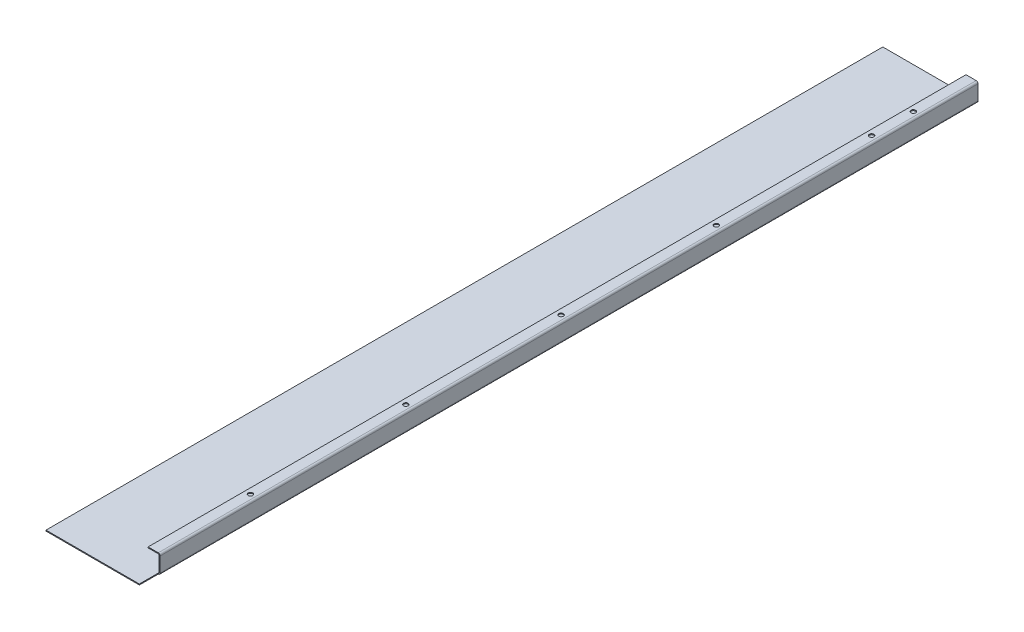
ISO-10303-21;
HEADER;
FILE_DESCRIPTION(('STEP AP214'),'2;1');
FILE_NAME('part.step','',(''),(''),'','','');
FILE_SCHEMA(('AUTOMOTIVE_DESIGN { 1 0 10303 214 1 1 1 1 }'));
ENDSEC;
DATA;
#1=APPLICATION_CONTEXT('core data for automotive mechanical design processes');
#2=APPLICATION_PROTOCOL_DEFINITION('international standard','automotive_design',2000,#1);
#3=PRODUCT_CONTEXT('',#1,'mechanical');
#4=PRODUCT('Part','Part','',(#3));
#5=PRODUCT_RELATED_PRODUCT_CATEGORY('part','',(#4));
#6=PRODUCT_DEFINITION_FORMATION('','',#4);
#7=PRODUCT_DEFINITION_CONTEXT('part definition',#1,'design');
#8=PRODUCT_DEFINITION('design','',#6,#7);
#9=PRODUCT_DEFINITION_SHAPE('','',#8);
#10=(LENGTH_UNIT() NAMED_UNIT(*) SI_UNIT(.MILLI.,.METRE.));
#11=(NAMED_UNIT(*) PLANE_ANGLE_UNIT() SI_UNIT($,.RADIAN.));
#12=(NAMED_UNIT(*) SI_UNIT($,.STERADIAN.) SOLID_ANGLE_UNIT());
#13=UNCERTAINTY_MEASURE_WITH_UNIT(LENGTH_MEASURE(1.E-05),#10,'distance_accuracy_value','');
#14=(GEOMETRIC_REPRESENTATION_CONTEXT(3) GLOBAL_UNCERTAINTY_ASSIGNED_CONTEXT((#13)) GLOBAL_UNIT_ASSIGNED_CONTEXT((#10,
#11,#12)) REPRESENTATION_CONTEXT('',''));
#15=CARTESIAN_POINT('',(0.,0.,0.));
#16=DIRECTION('',(0.,0.,1.));
#17=DIRECTION('',(1.,0.,0.));
#18=AXIS2_PLACEMENT_3D('',#15,#16,#17);
#19=CARTESIAN_POINT('',(103.,-3.79652571919077E-13,0.));
#20=DIRECTION('',(-1.,0.,0.));
#21=DIRECTION('',(0.,-1.,0.));
#22=AXIS2_PLACEMENT_3D('',#19,#20,#21);
#23=PLANE('',#22);
#24=DIRECTION('',(0.,-1.,0.));
#25=VECTOR('',#24,1.);
#26=CARTESIAN_POINT('',(103.,-3.79813140003343E-13,-20.5));
#27=LINE('',#26,#25);
#28=CARTESIAN_POINT('',(103.,17.,-20.5));
#29=VERTEX_POINT('',#28);
#30=CARTESIAN_POINT('',(103.,0.999999999999956,-20.5));
#31=VERTEX_POINT('',#30);
#32=EDGE_CURVE('E367',#29,#31,#27,.T.);
#33=ORIENTED_EDGE('',*,*,#32,.T.);
#34=DIRECTION('',(0.,0.,-1.));
#35=VECTOR('',#34,1.);
#36=CARTESIAN_POINT('',(103.,0.999999999999997,0.));
#37=LINE('',#36,#35);
#38=CARTESIAN_POINT('',(103.,0.999999999999956,-905.2));
#39=VERTEX_POINT('',#38);
#40=EDGE_CURVE('E237',#39,#31,#37,.F.);
#41=ORIENTED_EDGE('',*,*,#40,.F.);
#42=DIRECTION('',(0.,1.,0.));
#43=VECTOR('',#42,1.);
#44=CARTESIAN_POINT('',(103.,-3.79652571919076E-13,-905.2));
#45=LINE('',#44,#43);
#46=CARTESIAN_POINT('',(103.,17.,-905.2));
#47=VERTEX_POINT('',#46);
#48=EDGE_CURVE('E232',#39,#47,#45,.T.);
#49=ORIENTED_EDGE('',*,*,#48,.T.);
#50=DIRECTION('',(0.,0.,-1.));
#51=VECTOR('',#50,1.);
#52=CARTESIAN_POINT('',(103.,17.,-905.2));
#53=LINE('',#52,#51);
#54=EDGE_CURVE('E220',#47,#29,#53,.F.);
#55=ORIENTED_EDGE('',*,*,#54,.T.);
#56=EDGE_LOOP('',(#33,#41,#49,#55));
#57=FACE_BOUND('',#56,.T.);
#58=ADVANCED_FACE('F78',(#57),#23,.F.);
#59=CARTESIAN_POINT('',(102.,-3.76161090580234E-13,0.));
#60=DIRECTION('',(-1.,0.,0.));
#61=DIRECTION('',(0.,-1.,0.));
#62=AXIS2_PLACEMENT_3D('',#59,#60,#61);
#63=PLANE('',#62);
#64=DIRECTION('',(0.,0.,-1.));
#65=VECTOR('',#64,1.);
#66=CARTESIAN_POINT('',(102.,1.,0.));
#67=LINE('',#66,#65);
#68=CARTESIAN_POINT('',(102.,0.999999999999959,-20.5));
#69=VERTEX_POINT('',#68);
#70=CARTESIAN_POINT('',(102.,0.99999999999998,-905.2));
#71=VERTEX_POINT('',#70);
#72=EDGE_CURVE('E231',#69,#71,#67,.T.);
#73=ORIENTED_EDGE('',*,*,#72,.F.);
#74=DIRECTION('',(0.,-1.,0.));
#75=VECTOR('',#74,1.);
#76=CARTESIAN_POINT('',(102.,-3.76161090580234E-13,-20.5));
#77=LINE('',#76,#75);
#78=CARTESIAN_POINT('',(102.,17.,-20.5));
#79=VERTEX_POINT('',#78);
#80=EDGE_CURVE('E368',#79,#69,#77,.T.);
#81=ORIENTED_EDGE('',*,*,#80,.F.);
#82=DIRECTION('',(0.,0.,-1.));
#83=VECTOR('',#82,1.);
#84=CARTESIAN_POINT('',(102.,17.,-905.2));
#85=LINE('',#84,#83);
#86=CARTESIAN_POINT('',(102.,17.,-905.2));
#87=VERTEX_POINT('',#86);
#88=EDGE_CURVE('E103',#87,#79,#85,.F.);
#89=ORIENTED_EDGE('',*,*,#88,.F.);
#90=DIRECTION('',(0.,-1.,0.));
#91=VECTOR('',#90,1.);
#92=CARTESIAN_POINT('',(102.,19.,-905.2));
#93=LINE('',#92,#91);
#94=EDGE_CURVE('E235',#71,#87,#93,.F.);
#95=ORIENTED_EDGE('',*,*,#94,.F.);
#96=EDGE_LOOP('',(#73,#81,#89,#95));
#97=FACE_BOUND('',#96,.T.);
#98=ADVANCED_FACE('F385',(#97),#63,.T.);
#99=CARTESIAN_POINT('',(101.,0.999999999999984,-905.2));
#100=DIRECTION('',(0.,0.,-1.));
#101=DIRECTION('',(1.,0.,0.));
#102=AXIS2_PLACEMENT_3D('',#99,#100,#101);
#103=CYLINDRICAL_SURFACE('',#102,2.00000000000008);
#104=ORIENTED_EDGE('',*,*,#40,.T.);
#105=CARTESIAN_POINT('',(101.,0.9999999999999,-20.5));
#106=DIRECTION('',(0.,0.,-1.));
#107=DIRECTION('',(-1.,0.,0.));
#108=AXIS2_PLACEMENT_3D('',#105,#106,#107);
#109=CIRCLE('',#108,2.);
#110=CARTESIAN_POINT('',(101.,-1.0000000000001,-20.5));
#111=VERTEX_POINT('',#110);
#112=EDGE_CURVE('E337',#31,#111,#109,.T.);
#113=ORIENTED_EDGE('',*,*,#112,.T.);
#114=DIRECTION('',(0.,0.,-1.));
#115=VECTOR('',#114,1.);
#116=CARTESIAN_POINT('',(101.,-1.0000000000001,-905.2));
#117=LINE('',#116,#115);
#118=CARTESIAN_POINT('',(101.,-1.0000000000001,-905.2));
#119=VERTEX_POINT('',#118);
#120=EDGE_CURVE('E244',#119,#111,#117,.F.);
#121=ORIENTED_EDGE('',*,*,#120,.F.);
#122=CARTESIAN_POINT('',(101.,0.999999999999984,-905.2));
#123=DIRECTION('',(0.,0.,-1.));
#124=DIRECTION('',(-1.,0.,0.));
#125=AXIS2_PLACEMENT_3D('',#122,#123,#124);
#126=CIRCLE('',#125,2.00000000000008);
#127=EDGE_CURVE('E248',#39,#119,#126,.T.);
#128=ORIENTED_EDGE('',*,*,#127,.F.);
#129=EDGE_LOOP('',(#104,#113,#121,#128));
#130=FACE_BOUND('',#129,.T.);
#131=ADVANCED_FACE('F391',(#130),#103,.T.);
#132=CARTESIAN_POINT('',(101.,0.999999999999984,-905.2));
#133=DIRECTION('',(0.,0.,-1.));
#134=DIRECTION('',(1.,0.,0.));
#135=AXIS2_PLACEMENT_3D('',#132,#133,#134);
#136=CYLINDRICAL_SURFACE('',#135,1.00000000000008);
#137=CARTESIAN_POINT('',(101.,0.9999999999999,-20.5));
#138=DIRECTION('',(0.,0.,1.));
#139=DIRECTION('',(1.,0.,0.));
#140=AXIS2_PLACEMENT_3D('',#137,#138,#139);
#141=CIRCLE('',#140,1.);
#142=CARTESIAN_POINT('',(101.,-1.00397121172158E-13,-20.5000000000001));
#143=VERTEX_POINT('',#142);
#144=EDGE_CURVE('E353',#69,#143,#141,.F.);
#145=ORIENTED_EDGE('',*,*,#144,.F.);
#146=ORIENTED_EDGE('',*,*,#72,.T.);
#147=CARTESIAN_POINT('',(101.,0.999999999999984,-905.2));
#148=DIRECTION('',(0.,0.,-1.));
#149=DIRECTION('',(-1.,0.,0.));
#150=AXIS2_PLACEMENT_3D('',#147,#148,#149);
#151=CIRCLE('',#150,1.00000000000008);
#152=CARTESIAN_POINT('',(101.,-1.00397121172158E-13,-905.2));
#153=VERTEX_POINT('',#152);
#154=EDGE_CURVE('E234',#71,#153,#151,.T.);
#155=ORIENTED_EDGE('',*,*,#154,.T.);
#156=DIRECTION('',(0.,0.,-1.));
#157=VECTOR('',#156,1.);
#158=CARTESIAN_POINT('',(101.,-1.00397121172158E-13,-905.2));
#159=LINE('',#158,#157);
#160=EDGE_CURVE('E251',#153,#143,#159,.F.);
#161=ORIENTED_EDGE('',*,*,#160,.T.);
#162=EDGE_LOOP('',(#145,#146,#155,#161));
#163=FACE_BOUND('',#162,.T.);
#164=ADVANCED_FACE('F398',(#163),#136,.F.);
#165=CARTESIAN_POINT('',(101.,17.,-905.2));
#166=DIRECTION('',(0.,0.,-1.));
#167=DIRECTION('',(0.,1.,0.));
#168=AXIS2_PLACEMENT_3D('',#165,#166,#167);
#169=CYLINDRICAL_SURFACE('',#168,2.);
#170=DIRECTION('',(0.,0.,-1.));
#171=VECTOR('',#170,1.);
#172=CARTESIAN_POINT('',(101.,19.,0.));
#173=LINE('',#172,#171);
#174=CARTESIAN_POINT('',(101.,19.,-905.2));
#175=VERTEX_POINT('',#174);
#176=CARTESIAN_POINT('',(101.,19.,-20.5));
#177=VERTEX_POINT('',#176);
#178=EDGE_CURVE('E200',#175,#177,#173,.F.);
#179=ORIENTED_EDGE('',*,*,#178,.T.);
#180=CARTESIAN_POINT('',(101.,17.,-20.5000000000002));
#181=DIRECTION('',(0.,0.,-1.));
#182=DIRECTION('',(-1.,0.,0.));
#183=AXIS2_PLACEMENT_3D('',#180,#181,#182);
#184=CIRCLE('',#183,2.);
#185=EDGE_CURVE('E184',#177,#29,#184,.T.);
#186=ORIENTED_EDGE('',*,*,#185,.T.);
#187=ORIENTED_EDGE('',*,*,#54,.F.);
#188=CARTESIAN_POINT('',(101.,17.,-905.2));
#189=DIRECTION('',(0.,0.,-1.));
#190=DIRECTION('',(-1.,0.,0.));
#191=AXIS2_PLACEMENT_3D('',#188,#189,#190);
#192=CIRCLE('',#191,2.);
#193=EDGE_CURVE('E208',#175,#47,#192,.T.);
#194=ORIENTED_EDGE('',*,*,#193,.F.);
#195=EDGE_LOOP('',(#179,#186,#187,#194));
#196=FACE_BOUND('',#195,.T.);
#197=ADVANCED_FACE('F206',(#196),#169,.T.);
#198=CARTESIAN_POINT('',(101.,17.,-905.2));
#199=DIRECTION('',(0.,0.,-1.));
#200=DIRECTION('',(0.,1.,0.));
#201=AXIS2_PLACEMENT_3D('',#198,#199,#200);
#202=CYLINDRICAL_SURFACE('',#201,0.999999999999997);
#203=CARTESIAN_POINT('',(101.,17.,-20.5000000000002));
#204=DIRECTION('',(0.,0.,1.));
#205=DIRECTION('',(1.,0.,0.));
#206=AXIS2_PLACEMENT_3D('',#203,#204,#205);
#207=CIRCLE('',#206,1.);
#208=CARTESIAN_POINT('',(101.,18.,-20.5000000000002));
#209=VERTEX_POINT('',#208);
#210=EDGE_CURVE('E194',#209,#79,#207,.F.);
#211=ORIENTED_EDGE('',*,*,#210,.F.);
#212=DIRECTION('',(0.,0.,-1.));
#213=VECTOR('',#212,1.);
#214=CARTESIAN_POINT('',(101.,18.,0.));
#215=LINE('',#214,#213);
#216=CARTESIAN_POINT('',(101.,18.,-905.2));
#217=VERTEX_POINT('',#216);
#218=EDGE_CURVE('E215',#209,#217,#215,.T.);
#219=ORIENTED_EDGE('',*,*,#218,.T.);
#220=CARTESIAN_POINT('',(101.,17.,-905.2));
#221=DIRECTION('',(0.,0.,-1.));
#222=DIRECTION('',(-1.,0.,0.));
#223=AXIS2_PLACEMENT_3D('',#220,#221,#222);
#224=CIRCLE('',#223,0.999999999999997);
#225=EDGE_CURVE('E225',#217,#87,#224,.T.);
#226=ORIENTED_EDGE('',*,*,#225,.T.);
#227=ORIENTED_EDGE('',*,*,#88,.T.);
#228=EDGE_LOOP('',(#211,#219,#226,#227));
#229=FACE_BOUND('',#228,.T.);
#230=ADVANCED_FACE('F319',(#229),#202,.F.);
#231=CARTESIAN_POINT('',(1.40823756520346E-13,19.0000000000007,0.));
#232=DIRECTION('',(0.,-1.,0.));
#233=DIRECTION('',(1.,0.,0.));
#234=AXIS2_PLACEMENT_3D('',#231,#232,#233);
#235=PLANE('',#234);
#236=CARTESIAN_POINT('',(96.0000000000165,19.,-125.2));
#237=DIRECTION('',(0.,1.,0.));
#238=DIRECTION('',(-1.,0.,0.));
#239=AXIS2_PLACEMENT_3D('',#236,#237,#238);
#240=CIRCLE('',#239,2.5);
#241=CARTESIAN_POINT('',(93.5000000000165,19.0000000000001,-125.2));
#242=VERTEX_POINT('',#241);
#243=EDGE_CURVE('E333',#242,#242,#240,.T.);
#244=ORIENTED_EDGE('',*,*,#243,.F.);
#245=EDGE_LOOP('',(#244));
#246=FACE_BOUND('',#245,.T.);
#247=CARTESIAN_POINT('',(96.0000000000123,19.,-293.2));
#248=DIRECTION('',(0.,1.,0.));
#249=DIRECTION('',(-1.,0.,0.));
#250=AXIS2_PLACEMENT_3D('',#247,#248,#249);
#251=CIRCLE('',#250,2.50000000000001);
#252=CARTESIAN_POINT('',(93.5000000000123,19.0000000000001,-293.2));
#253=VERTEX_POINT('',#252);
#254=EDGE_CURVE('E336',#253,#253,#251,.T.);
#255=ORIENTED_EDGE('',*,*,#254,.F.);
#256=EDGE_LOOP('',(#255));
#257=FACE_BOUND('',#256,.T.);
#258=CARTESIAN_POINT('',(96.0000000000082,19.,-461.2));
#259=DIRECTION('',(0.,1.,0.));
#260=DIRECTION('',(-1.,0.,0.));
#261=AXIS2_PLACEMENT_3D('',#258,#259,#260);
#262=CIRCLE('',#261,2.50000000000001);
#263=CARTESIAN_POINT('',(93.5000000000082,19.0000000000001,-461.2));
#264=VERTEX_POINT('',#263);
#265=EDGE_CURVE('E340',#264,#264,#262,.T.);
#266=ORIENTED_EDGE('',*,*,#265,.F.);
#267=EDGE_LOOP('',(#266));
#268=FACE_BOUND('',#267,.T.);
#269=CARTESIAN_POINT('',(96.0000000000041,19.,-629.2));
#270=DIRECTION('',(0.,1.,0.));
#271=DIRECTION('',(-1.,0.,0.));
#272=AXIS2_PLACEMENT_3D('',#269,#270,#271);
#273=CIRCLE('',#272,2.5);
#274=CARTESIAN_POINT('',(93.5000000000041,19.0000000000001,-629.2));
#275=VERTEX_POINT('',#274);
#276=EDGE_CURVE('E343',#275,#275,#273,.T.);
#277=ORIENTED_EDGE('',*,*,#276,.F.);
#278=EDGE_LOOP('',(#277));
#279=FACE_BOUND('',#278,.T.);
#280=CARTESIAN_POINT('',(95.9999999999999,19.,-797.2));
#281=DIRECTION('',(0.,1.,0.));
#282=DIRECTION('',(-1.,0.,0.));
#283=AXIS2_PLACEMENT_3D('',#280,#281,#282);
#284=CIRCLE('',#283,2.50000000000001);
#285=CARTESIAN_POINT('',(93.4999999999999,19.0000000000001,-797.2));
#286=VERTEX_POINT('',#285);
#287=EDGE_CURVE('E346',#286,#286,#284,.T.);
#288=ORIENTED_EDGE('',*,*,#287,.F.);
#289=EDGE_LOOP('',(#288));
#290=FACE_BOUND('',#289,.T.);
#291=CARTESIAN_POINT('',(95.9999999999999,19.,-842.2));
#292=DIRECTION('',(0.,1.,0.));
#293=DIRECTION('',(-1.,0.,0.));
#294=AXIS2_PLACEMENT_3D('',#291,#292,#293);
#295=CIRCLE('',#294,2.5);
#296=CARTESIAN_POINT('',(93.4999999999999,19.0000000000001,-842.2));
#297=VERTEX_POINT('',#296);
#298=EDGE_CURVE('E281',#297,#297,#295,.T.);
#299=ORIENTED_EDGE('',*,*,#298,.F.);
#300=EDGE_LOOP('',(#299));
#301=FACE_BOUND('',#300,.T.);
#302=DIRECTION('',(1.,0.,0.));
#303=VECTOR('',#302,1.);
#304=CARTESIAN_POINT('',(1.4090824024163E-13,19.0000000000007,-20.5));
#305=LINE('',#304,#303);
#306=CARTESIAN_POINT('',(90.0000000000001,19.0000000000001,-20.5));
#307=VERTEX_POINT('',#306);
#308=EDGE_CURVE('E95',#307,#177,#305,.T.);
#309=ORIENTED_EDGE('',*,*,#308,.T.);
#310=ORIENTED_EDGE('',*,*,#178,.F.);
#311=DIRECTION('',(-1.,0.,0.));
#312=VECTOR('',#311,1.);
#313=CARTESIAN_POINT('',(1.40823756520346E-13,19.0000000000007,-905.2));
#314=LINE('',#313,#312);
#315=CARTESIAN_POINT('',(89.9999999999999,19.0000000000001,-905.2));
#316=VERTEX_POINT('',#315);
#317=EDGE_CURVE('E327',#175,#316,#314,.T.);
#318=ORIENTED_EDGE('',*,*,#317,.T.);
#319=DIRECTION('',(0.,0.,1.));
#320=VECTOR('',#319,1.);
#321=CARTESIAN_POINT('',(90.0000000000001,19.0000000000001,0.));
#322=LINE('',#321,#320);
#323=EDGE_CURVE('E203',#316,#307,#322,.T.);
#324=ORIENTED_EDGE('',*,*,#323,.T.);
#325=EDGE_LOOP('',(#309,#310,#318,#324));
#326=FACE_BOUND('',#325,.T.);
#327=ADVANCED_FACE('F199',(#246,#257,#268,#279,#290,#301,#326),#235,.F.);
#328=CARTESIAN_POINT('',(1.33680225758394E-13,18.0000000000007,0.));
#329=DIRECTION('',(0.,-1.,0.));
#330=DIRECTION('',(1.,0.,0.));
#331=AXIS2_PLACEMENT_3D('',#328,#329,#330);
#332=PLANE('',#331);
#333=CARTESIAN_POINT('',(95.9999999999999,18.,-842.2));
#334=DIRECTION('',(0.,-1.,0.));
#335=DIRECTION('',(1.,0.,0.));
#336=AXIS2_PLACEMENT_3D('',#333,#334,#335);
#337=CIRCLE('',#336,2.5);
#338=CARTESIAN_POINT('',(98.4999999999999,18.,-842.2));
#339=VERTEX_POINT('',#338);
#340=EDGE_CURVE('E82',#339,#339,#337,.T.);
#341=ORIENTED_EDGE('',*,*,#340,.F.);
#342=EDGE_LOOP('',(#341));
#343=FACE_BOUND('',#342,.T.);
#344=CARTESIAN_POINT('',(95.9999999999999,18.,-797.2));
#345=DIRECTION('',(0.,-1.,0.));
#346=DIRECTION('',(1.,0.,0.));
#347=AXIS2_PLACEMENT_3D('',#344,#345,#346);
#348=CIRCLE('',#347,2.50000000000001);
#349=CARTESIAN_POINT('',(98.4999999999999,18.,-797.2));
#350=VERTEX_POINT('',#349);
#351=EDGE_CURVE('E289',#350,#350,#348,.T.);
#352=ORIENTED_EDGE('',*,*,#351,.F.);
#353=EDGE_LOOP('',(#352));
#354=FACE_BOUND('',#353,.T.);
#355=CARTESIAN_POINT('',(96.0000000000041,18.,-629.2));
#356=DIRECTION('',(0.,-1.,0.));
#357=DIRECTION('',(1.,0.,0.));
#358=AXIS2_PLACEMENT_3D('',#355,#356,#357);
#359=CIRCLE('',#358,2.5);
#360=CARTESIAN_POINT('',(98.5000000000041,18.,-629.2));
#361=VERTEX_POINT('',#360);
#362=EDGE_CURVE('E287',#361,#361,#359,.T.);
#363=ORIENTED_EDGE('',*,*,#362,.F.);
#364=EDGE_LOOP('',(#363));
#365=FACE_BOUND('',#364,.T.);
#366=CARTESIAN_POINT('',(96.0000000000082,18.,-461.2));
#367=DIRECTION('',(0.,-1.,0.));
#368=DIRECTION('',(1.,0.,0.));
#369=AXIS2_PLACEMENT_3D('',#366,#367,#368);
#370=CIRCLE('',#369,2.50000000000001);
#371=CARTESIAN_POINT('',(98.5000000000082,18.,-461.2));
#372=VERTEX_POINT('',#371);
#373=EDGE_CURVE('E284',#372,#372,#370,.T.);
#374=ORIENTED_EDGE('',*,*,#373,.F.);
#375=EDGE_LOOP('',(#374));
#376=FACE_BOUND('',#375,.T.);
#377=CARTESIAN_POINT('',(96.0000000000123,18.,-293.2));
#378=DIRECTION('',(0.,-1.,0.));
#379=DIRECTION('',(1.,0.,0.));
#380=AXIS2_PLACEMENT_3D('',#377,#378,#379);
#381=CIRCLE('',#380,2.50000000000001);
#382=CARTESIAN_POINT('',(98.5000000000123,18.,-293.2));
#383=VERTEX_POINT('',#382);
#384=EDGE_CURVE('E280',#383,#383,#381,.T.);
#385=ORIENTED_EDGE('',*,*,#384,.F.);
#386=EDGE_LOOP('',(#385));
#387=FACE_BOUND('',#386,.T.);
#388=CARTESIAN_POINT('',(96.0000000000165,18.,-125.2));
#389=DIRECTION('',(0.,-1.,0.));
#390=DIRECTION('',(1.,0.,0.));
#391=AXIS2_PLACEMENT_3D('',#388,#389,#390);
#392=CIRCLE('',#391,2.5);
#393=CARTESIAN_POINT('',(98.5000000000165,18.,-125.2));
#394=VERTEX_POINT('',#393);
#395=EDGE_CURVE('E277',#394,#394,#392,.T.);
#396=ORIENTED_EDGE('',*,*,#395,.F.);
#397=EDGE_LOOP('',(#396));
#398=FACE_BOUND('',#397,.T.);
#399=ORIENTED_EDGE('',*,*,#218,.F.);
#400=DIRECTION('',(1.,0.,0.));
#401=VECTOR('',#400,1.);
#402=CARTESIAN_POINT('',(1.30156829789573E-13,18.0000000000007,-20.5));
#403=LINE('',#402,#401);
#404=CARTESIAN_POINT('',(90.0000000000001,18.0000000000001,-20.5));
#405=VERTEX_POINT('',#404);
#406=EDGE_CURVE('E179',#405,#209,#403,.T.);
#407=ORIENTED_EDGE('',*,*,#406,.F.);
#408=DIRECTION('',(0.,0.,-1.));
#409=VECTOR('',#408,1.);
#410=CARTESIAN_POINT('',(90.0000000000001,18.0000000000001,0.));
#411=LINE('',#410,#409);
#412=CARTESIAN_POINT('',(89.9999999999999,18.0000000000001,-905.2));
#413=VERTEX_POINT('',#412);
#414=EDGE_CURVE('E213',#413,#405,#411,.F.);
#415=ORIENTED_EDGE('',*,*,#414,.F.);
#416=DIRECTION('',(1.,0.,0.));
#417=VECTOR('',#416,1.);
#418=CARTESIAN_POINT('',(89.9999999999999,18.0000000000001,-905.2));
#419=LINE('',#418,#417);
#420=EDGE_CURVE('E210',#217,#413,#419,.F.);
#421=ORIENTED_EDGE('',*,*,#420,.F.);
#422=EDGE_LOOP('',(#399,#407,#415,#421));
#423=FACE_BOUND('',#422,.T.);
#424=ADVANCED_FACE('F299',(#343,#354,#365,#376,#387,#398,#423),#332,.T.);
#425=CARTESIAN_POINT('',(90.0000000000001,19.0000000000001,0.));
#426=DIRECTION('',(1.,0.,0.));
#427=DIRECTION('',(0.,1.,0.));
#428=AXIS2_PLACEMENT_3D('',#425,#426,#427);
#429=PLANE('',#428);
#430=DIRECTION('',(0.,-1.,0.));
#431=VECTOR('',#430,1.);
#432=CARTESIAN_POINT('',(90.0000000000001,18.0000000000001,-20.5));
#433=LINE('',#432,#431);
#434=EDGE_CURVE('E204',#405,#307,#433,.F.);
#435=ORIENTED_EDGE('',*,*,#434,.T.);
#436=ORIENTED_EDGE('',*,*,#323,.F.);
#437=DIRECTION('',(0.,-1.,0.));
#438=VECTOR('',#437,1.);
#439=CARTESIAN_POINT('',(89.9999999999999,19.0000000000001,-905.2));
#440=LINE('',#439,#438);
#441=EDGE_CURVE('E228',#316,#413,#440,.T.);
#442=ORIENTED_EDGE('',*,*,#441,.T.);
#443=ORIENTED_EDGE('',*,*,#414,.T.);
#444=EDGE_LOOP('',(#435,#436,#442,#443));
#445=FACE_BOUND('',#444,.T.);
#446=ADVANCED_FACE('F302',(#445),#429,.F.);
#447=CARTESIAN_POINT('',(103.,19.,-905.2));
#448=DIRECTION('',(0.,0.,1.));
#449=DIRECTION('',(1.,0.,0.));
#450=AXIS2_PLACEMENT_3D('',#447,#448,#449);
#451=PLANE('',#450);
#452=DIRECTION('',(1.,0.,0.));
#453=VECTOR('',#452,1.);
#454=CARTESIAN_POINT('',(102.,17.,-905.2));
#455=LINE('',#454,#453);
#456=EDGE_CURVE('E222',#87,#47,#455,.T.);
#457=ORIENTED_EDGE('',*,*,#456,.T.);
#458=ORIENTED_EDGE('',*,*,#48,.F.);
#459=DIRECTION('',(-1.,0.,0.));
#460=VECTOR('',#459,1.);
#461=CARTESIAN_POINT('',(102.,0.999999999999959,-905.2));
#462=LINE('',#461,#460);
#463=EDGE_CURVE('E240',#71,#39,#462,.F.);
#464=ORIENTED_EDGE('',*,*,#463,.F.);
#465=ORIENTED_EDGE('',*,*,#94,.T.);
#466=EDGE_LOOP('',(#457,#458,#464,#465));
#467=FACE_BOUND('',#466,.T.);
#468=ADVANCED_FACE('F375',(#467),#451,.F.);
#469=CARTESIAN_POINT('',(-1.94289029309402E-13,-1.,-905.2));
#470=DIRECTION('',(0.,0.,-1.));
#471=DIRECTION('',(-1.,0.,0.));
#472=AXIS2_PLACEMENT_3D('',#469,#470,#471);
#473=PLANE('',#472);
#474=DIRECTION('',(-1.,0.,0.));
#475=VECTOR('',#474,1.);
#476=CARTESIAN_POINT('',(-1.94289029309402E-13,0.,-905.2));
#477=LINE('',#476,#475);
#478=CARTESIAN_POINT('',(-1.94289029309402E-13,0.,-905.2));
#479=VERTEX_POINT('',#478);
#480=EDGE_CURVE('E265',#153,#479,#477,.T.);
#481=ORIENTED_EDGE('',*,*,#480,.F.);
#482=DIRECTION('',(0.,-1.,0.));
#483=VECTOR('',#482,1.);
#484=CARTESIAN_POINT('',(101.,-1.00397121172158E-13,-905.2));
#485=LINE('',#484,#483);
#486=EDGE_CURVE('E247',#153,#119,#485,.T.);
#487=ORIENTED_EDGE('',*,*,#486,.T.);
#488=DIRECTION('',(-1.,0.,0.));
#489=VECTOR('',#488,1.);
#490=CARTESIAN_POINT('',(-1.94289029309402E-13,-1.,-905.2));
#491=LINE('',#490,#489);
#492=CARTESIAN_POINT('',(-1.94289029309402E-13,-1.,-905.2));
#493=VERTEX_POINT('',#492);
#494=EDGE_CURVE('E268',#119,#493,#491,.T.);
#495=ORIENTED_EDGE('',*,*,#494,.T.);
#496=DIRECTION('',(0.,1.,0.));
#497=VECTOR('',#496,1.);
#498=CARTESIAN_POINT('',(-1.94289029309402E-13,-1.,-905.2));
#499=LINE('',#498,#497);
#500=EDGE_CURVE('E13',#493,#479,#499,.T.);
#501=ORIENTED_EDGE('',*,*,#500,.T.);
#502=EDGE_LOOP('',(#481,#487,#495,#501));
#503=FACE_BOUND('',#502,.T.);
#504=ADVANCED_FACE('F380',(#503),#473,.T.);
#505=CARTESIAN_POINT('',(0.,-1.,0.));
#506=DIRECTION('',(0.,-1.,0.));
#507=DIRECTION('',(0.,0.,-1.));
#508=AXIS2_PLACEMENT_3D('',#505,#506,#507);
#509=PLANE('',#508);
#510=ORIENTED_EDGE('',*,*,#494,.F.);
#511=ORIENTED_EDGE('',*,*,#120,.T.);
#512=DIRECTION('',(0.,0.,-1.));
#513=VECTOR('',#512,1.);
#514=CARTESIAN_POINT('',(101.,-1.0000000000001,-905.2));
#515=LINE('',#514,#513);
#516=CARTESIAN_POINT('',(101.,-1.0000000000001,0.));
#517=VERTEX_POINT('',#516);
#518=EDGE_CURVE('E358',#111,#517,#515,.F.);
#519=ORIENTED_EDGE('',*,*,#518,.T.);
#520=DIRECTION('',(1.,0.,0.));
#521=VECTOR('',#520,1.);
#522=CARTESIAN_POINT('',(0.,-1.,0.));
#523=LINE('',#522,#521);
#524=CARTESIAN_POINT('',(0.,-1.,0.));
#525=VERTEX_POINT('',#524);
#526=EDGE_CURVE('E264',#525,#517,#523,.T.);
#527=ORIENTED_EDGE('',*,*,#526,.F.);
#528=DIRECTION('',(0.,0.,1.));
#529=VECTOR('',#528,1.);
#530=CARTESIAN_POINT('',(0.,-1.,0.));
#531=LINE('',#530,#529);
#532=EDGE_CURVE('E261',#493,#525,#531,.T.);
#533=ORIENTED_EDGE('',*,*,#532,.F.);
#534=EDGE_LOOP('',(#510,#511,#519,#527,#533));
#535=FACE_BOUND('',#534,.T.);
#536=ADVANCED_FACE('F408',(#535),#509,.T.);
#537=CARTESIAN_POINT('',(0.,0.,0.));
#538=DIRECTION('',(0.,-1.,0.));
#539=DIRECTION('',(0.,0.,-1.));
#540=AXIS2_PLACEMENT_3D('',#537,#538,#539);
#541=PLANE('',#540);
#542=ORIENTED_EDGE('',*,*,#160,.F.);
#543=ORIENTED_EDGE('',*,*,#480,.T.);
#544=DIRECTION('',(0.,0.,1.));
#545=VECTOR('',#544,1.);
#546=CARTESIAN_POINT('',(0.,0.,0.));
#547=LINE('',#546,#545);
#548=CARTESIAN_POINT('',(0.,0.,0.));
#549=VERTEX_POINT('',#548);
#550=EDGE_CURVE('E258',#479,#549,#547,.T.);
#551=ORIENTED_EDGE('',*,*,#550,.T.);
#552=DIRECTION('',(1.,0.,0.));
#553=VECTOR('',#552,1.);
#554=CARTESIAN_POINT('',(0.,0.,0.));
#555=LINE('',#554,#553);
#556=CARTESIAN_POINT('',(101.,-1.00397121172158E-13,0.));
#557=VERTEX_POINT('',#556);
#558=EDGE_CURVE('E272',#549,#557,#555,.T.);
#559=ORIENTED_EDGE('',*,*,#558,.T.);
#560=DIRECTION('',(0.,0.,-1.));
#561=VECTOR('',#560,1.);
#562=CARTESIAN_POINT('',(101.,-1.00397121172158E-13,-905.2));
#563=LINE('',#562,#561);
#564=EDGE_CURVE('E361',#143,#557,#563,.F.);
#565=ORIENTED_EDGE('',*,*,#564,.F.);
#566=EDGE_LOOP('',(#542,#543,#551,#559,#565));
#567=FACE_BOUND('',#566,.T.);
#568=ADVANCED_FACE('F411',(#567),#541,.F.);
#569=CARTESIAN_POINT('',(0.,-1.,0.));
#570=DIRECTION('',(-1.,0.,0.));
#571=DIRECTION('',(0.,0.,1.));
#572=AXIS2_PLACEMENT_3D('',#569,#570,#571);
#573=PLANE('',#572);
#574=ORIENTED_EDGE('',*,*,#550,.F.);
#575=ORIENTED_EDGE('',*,*,#500,.F.);
#576=ORIENTED_EDGE('',*,*,#532,.T.);
#577=DIRECTION('',(0.,1.,0.));
#578=VECTOR('',#577,1.);
#579=CARTESIAN_POINT('',(0.,-1.,0.));
#580=LINE('',#579,#578);
#581=EDGE_CURVE('E87',#525,#549,#580,.T.);
#582=ORIENTED_EDGE('',*,*,#581,.T.);
#583=EDGE_LOOP('',(#574,#575,#576,#582));
#584=FACE_BOUND('',#583,.T.);
#585=ADVANCED_FACE('F80',(#584),#573,.T.);
#586=CARTESIAN_POINT('',(0.,-1.,0.));
#587=DIRECTION('',(0.,0.,1.));
#588=DIRECTION('',(1.,0.,0.));
#589=AXIS2_PLACEMENT_3D('',#586,#587,#588);
#590=PLANE('',#589);
#591=DIRECTION('',(0.,-1.,0.));
#592=VECTOR('',#591,1.);
#593=CARTESIAN_POINT('',(101.,-1.00397121172158E-13,0.));
#594=LINE('',#593,#592);
#595=EDGE_CURVE('E256',#557,#517,#594,.T.);
#596=ORIENTED_EDGE('',*,*,#595,.F.);
#597=ORIENTED_EDGE('',*,*,#558,.F.);
#598=ORIENTED_EDGE('',*,*,#581,.F.);
#599=ORIENTED_EDGE('',*,*,#526,.T.);
#600=EDGE_LOOP('',(#596,#597,#598,#599));
#601=FACE_BOUND('',#600,.T.);
#602=ADVANCED_FACE('F406',(#601),#590,.T.);
#603=CARTESIAN_POINT('',(101.,0.999999999999984,-905.2));
#604=DIRECTION('',(0.,0.,1.));
#605=DIRECTION('',(1.,0.,0.));
#606=AXIS2_PLACEMENT_3D('',#603,#604,#605);
#607=PLANE('',#606);
#608=ORIENTED_EDGE('',*,*,#154,.F.);
#609=ORIENTED_EDGE('',*,*,#463,.T.);
#610=ORIENTED_EDGE('',*,*,#127,.T.);
#611=ORIENTED_EDGE('',*,*,#486,.F.);
#612=EDGE_LOOP('',(#608,#609,#610,#611));
#613=FACE_BOUND('',#612,.T.);
#614=ADVANCED_FACE('F403',(#613),#607,.F.);
#615=CARTESIAN_POINT('',(101.,17.,-905.2));
#616=DIRECTION('',(0.,0.,1.));
#617=DIRECTION('',(1.,0.,0.));
#618=AXIS2_PLACEMENT_3D('',#615,#616,#617);
#619=PLANE('',#618);
#620=ORIENTED_EDGE('',*,*,#225,.F.);
#621=DIRECTION('',(0.,-1.,0.));
#622=VECTOR('',#621,1.);
#623=CARTESIAN_POINT('',(101.,18.,-905.2));
#624=LINE('',#623,#622);
#625=EDGE_CURVE('E211',#217,#175,#624,.F.);
#626=ORIENTED_EDGE('',*,*,#625,.T.);
#627=ORIENTED_EDGE('',*,*,#193,.T.);
#628=ORIENTED_EDGE('',*,*,#456,.F.);
#629=EDGE_LOOP('',(#620,#626,#627,#628));
#630=FACE_BOUND('',#629,.T.);
#631=ADVANCED_FACE('F323',(#630),#619,.F.);
#632=CARTESIAN_POINT('',(89.9999999999999,19.0000000000001,-905.2));
#633=DIRECTION('',(0.,0.,1.));
#634=DIRECTION('',(0.,-1.,0.));
#635=AXIS2_PLACEMENT_3D('',#632,#633,#634);
#636=PLANE('',#635);
#637=ORIENTED_EDGE('',*,*,#625,.F.);
#638=ORIENTED_EDGE('',*,*,#420,.T.);
#639=ORIENTED_EDGE('',*,*,#441,.F.);
#640=ORIENTED_EDGE('',*,*,#317,.F.);
#641=EDGE_LOOP('',(#637,#638,#639,#640));
#642=FACE_BOUND('',#641,.T.);
#643=ADVANCED_FACE('F325',(#642),#636,.F.);
#644=CARTESIAN_POINT('',(96.0000000000164,9.00000000000004,-125.2));
#645=DIRECTION('',(0.,1.,0.));
#646=DIRECTION('',(-1.,0.,0.));
#647=AXIS2_PLACEMENT_3D('',#644,#645,#646);
#648=CYLINDRICAL_SURFACE('',#647,2.5);
#649=ORIENTED_EDGE('',*,*,#395,.T.);
#650=EDGE_LOOP('',(#649));
#651=FACE_BOUND('',#650,.T.);
#652=ORIENTED_EDGE('',*,*,#243,.T.);
#653=EDGE_LOOP('',(#652));
#654=FACE_BOUND('',#653,.T.);
#655=ADVANCED_FACE('F472',(#651,#654),#648,.F.);
#656=CARTESIAN_POINT('',(96.0000000000123,9.00000000000004,-293.2));
#657=DIRECTION('',(0.,1.,0.));
#658=DIRECTION('',(-1.,0.,0.));
#659=AXIS2_PLACEMENT_3D('',#656,#657,#658);
#660=CYLINDRICAL_SURFACE('',#659,2.50000000000001);
#661=ORIENTED_EDGE('',*,*,#384,.T.);
#662=EDGE_LOOP('',(#661));
#663=FACE_BOUND('',#662,.T.);
#664=ORIENTED_EDGE('',*,*,#254,.T.);
#665=EDGE_LOOP('',(#664));
#666=FACE_BOUND('',#665,.T.);
#667=ADVANCED_FACE('F468',(#663,#666),#660,.F.);
#668=CARTESIAN_POINT('',(96.0000000000081,9.00000000000004,-461.2));
#669=DIRECTION('',(0.,1.,0.));
#670=DIRECTION('',(-1.,0.,0.));
#671=AXIS2_PLACEMENT_3D('',#668,#669,#670);
#672=CYLINDRICAL_SURFACE('',#671,2.50000000000001);
#673=ORIENTED_EDGE('',*,*,#373,.T.);
#674=EDGE_LOOP('',(#673));
#675=FACE_BOUND('',#674,.T.);
#676=ORIENTED_EDGE('',*,*,#265,.T.);
#677=EDGE_LOOP('',(#676));
#678=FACE_BOUND('',#677,.T.);
#679=ADVANCED_FACE('F464',(#675,#678),#672,.F.);
#680=CARTESIAN_POINT('',(96.000000000004,9.00000000000004,-629.2));
#681=DIRECTION('',(0.,1.,0.));
#682=DIRECTION('',(-1.,0.,0.));
#683=AXIS2_PLACEMENT_3D('',#680,#681,#682);
#684=CYLINDRICAL_SURFACE('',#683,2.5);
#685=ORIENTED_EDGE('',*,*,#362,.T.);
#686=EDGE_LOOP('',(#685));
#687=FACE_BOUND('',#686,.T.);
#688=ORIENTED_EDGE('',*,*,#276,.T.);
#689=EDGE_LOOP('',(#688));
#690=FACE_BOUND('',#689,.T.);
#691=ADVANCED_FACE('F461',(#687,#690),#684,.F.);
#692=CARTESIAN_POINT('',(95.9999999999998,9.00000000000004,-797.2));
#693=DIRECTION('',(0.,1.,0.));
#694=DIRECTION('',(-1.,0.,0.));
#695=AXIS2_PLACEMENT_3D('',#692,#693,#694);
#696=CYLINDRICAL_SURFACE('',#695,2.50000000000001);
#697=ORIENTED_EDGE('',*,*,#351,.T.);
#698=EDGE_LOOP('',(#697));
#699=FACE_BOUND('',#698,.T.);
#700=ORIENTED_EDGE('',*,*,#287,.T.);
#701=EDGE_LOOP('',(#700));
#702=FACE_BOUND('',#701,.T.);
#703=ADVANCED_FACE('F455',(#699,#702),#696,.F.);
#704=CARTESIAN_POINT('',(95.9999999999998,9.00000000000004,-842.2));
#705=DIRECTION('',(0.,1.,0.));
#706=DIRECTION('',(-1.,0.,0.));
#707=AXIS2_PLACEMENT_3D('',#704,#705,#706);
#708=CYLINDRICAL_SURFACE('',#707,2.5);
#709=ORIENTED_EDGE('',*,*,#340,.T.);
#710=EDGE_LOOP('',(#709));
#711=FACE_BOUND('',#710,.T.);
#712=ORIENTED_EDGE('',*,*,#298,.T.);
#713=EDGE_LOOP('',(#712));
#714=FACE_BOUND('',#713,.T.);
#715=ADVANCED_FACE('F296',(#711,#714),#708,.F.);
#716=CARTESIAN_POINT('',(101.,0.9999999999999,-20.5));
#717=DIRECTION('',(0.,0.,1.));
#718=DIRECTION('',(1.,0.,0.));
#719=AXIS2_PLACEMENT_3D('',#716,#717,#718);
#720=PLANE('',#719);
#721=DIRECTION('',(-1.,0.,0.));
#722=VECTOR('',#721,1.);
#723=CARTESIAN_POINT('',(103.,0.999999999999723,-20.5));
#724=LINE('',#723,#722);
#725=EDGE_CURVE('E183',#31,#69,#724,.T.);
#726=ORIENTED_EDGE('',*,*,#725,.T.);
#727=ORIENTED_EDGE('',*,*,#144,.T.);
#728=DIRECTION('',(0.,-1.,0.));
#729=VECTOR('',#728,1.);
#730=CARTESIAN_POINT('',(101.,-3.68856991734015E-13,-20.5));
#731=LINE('',#730,#729);
#732=EDGE_CURVE('E356',#143,#111,#731,.T.);
#733=ORIENTED_EDGE('',*,*,#732,.T.);
#734=ORIENTED_EDGE('',*,*,#112,.F.);
#735=EDGE_LOOP('',(#726,#727,#733,#734));
#736=FACE_BOUND('',#735,.T.);
#737=ADVANCED_FACE('F447',(#736),#720,.T.);
#738=CARTESIAN_POINT('',(101.,-1.00397121172158E-13,-10.2500000000001));
#739=DIRECTION('',(-1.,0.,0.));
#740=DIRECTION('',(0.,0.,-1.));
#741=AXIS2_PLACEMENT_3D('',#738,#739,#740);
#742=PLANE('',#741);
#743=ORIENTED_EDGE('',*,*,#564,.T.);
#744=ORIENTED_EDGE('',*,*,#595,.T.);
#745=ORIENTED_EDGE('',*,*,#518,.F.);
#746=ORIENTED_EDGE('',*,*,#732,.F.);
#747=EDGE_LOOP('',(#743,#744,#745,#746));
#748=FACE_BOUND('',#747,.T.);
#749=ADVANCED_FACE('F429',(#748),#742,.F.);
#750=CARTESIAN_POINT('',(101.,17.,-20.5000000000002));
#751=DIRECTION('',(0.,0.,1.));
#752=DIRECTION('',(1.,0.,0.));
#753=AXIS2_PLACEMENT_3D('',#750,#751,#752);
#754=PLANE('',#753);
#755=ORIENTED_EDGE('',*,*,#210,.T.);
#756=DIRECTION('',(1.,0.,0.));
#757=VECTOR('',#756,1.);
#758=CARTESIAN_POINT('',(102.,17.,-20.5));
#759=LINE('',#758,#757);
#760=EDGE_CURVE('E189',#79,#29,#759,.T.);
#761=ORIENTED_EDGE('',*,*,#760,.T.);
#762=ORIENTED_EDGE('',*,*,#185,.F.);
#763=DIRECTION('',(1.11022302462516E-13,1.,0.));
#764=VECTOR('',#763,1.);
#765=CARTESIAN_POINT('',(101.,17.9999999999998,-20.5));
#766=LINE('',#765,#764);
#767=EDGE_CURVE('E175',#209,#177,#766,.T.);
#768=ORIENTED_EDGE('',*,*,#767,.F.);
#769=EDGE_LOOP('',(#755,#761,#762,#768));
#770=FACE_BOUND('',#769,.T.);
#771=ADVANCED_FACE('F188',(#770),#754,.T.);
#772=CARTESIAN_POINT('',(102.,-3.76161090580234E-13,-20.5));
#773=DIRECTION('',(0.,0.,-1.));
#774=DIRECTION('',(0.,-1.,0.));
#775=AXIS2_PLACEMENT_3D('',#772,#773,#774);
#776=PLANE('',#775);
#777=ORIENTED_EDGE('',*,*,#80,.T.);
#778=ORIENTED_EDGE('',*,*,#725,.F.);
#779=ORIENTED_EDGE('',*,*,#32,.F.);
#780=ORIENTED_EDGE('',*,*,#760,.F.);
#781=EDGE_LOOP('',(#777,#778,#779,#780));
#782=FACE_BOUND('',#781,.T.);
#783=ADVANCED_FACE('F445',(#782),#776,.F.);
#784=CARTESIAN_POINT('',(1.30156829789573E-13,18.0000000000007,-20.5));
#785=DIRECTION('',(0.,0.,-1.));
#786=DIRECTION('',(1.,0.,0.));
#787=AXIS2_PLACEMENT_3D('',#784,#785,#786);
#788=PLANE('',#787);
#789=ORIENTED_EDGE('',*,*,#406,.T.);
#790=ORIENTED_EDGE('',*,*,#767,.T.);
#791=ORIENTED_EDGE('',*,*,#308,.F.);
#792=ORIENTED_EDGE('',*,*,#434,.F.);
#793=EDGE_LOOP('',(#789,#790,#791,#792));
#794=FACE_BOUND('',#793,.T.);
#795=ADVANCED_FACE('F177',(#794),#788,.F.);
#796=CLOSED_SHELL('',(#58,#98,#131,#164,#197,#230,#327,#424,#446,#468,#504,#536,#568,#585,#602,
#614,#631,#643,#655,#667,#679,#691,#703,#715,#737,#749,#771,#783,#795));
#797=MANIFOLD_SOLID_BREP('B2',#796);
#798=ADVANCED_BREP_SHAPE_REPRESENTATION('',(#18,#797),#14);
#799=SHAPE_DEFINITION_REPRESENTATION(#9,#798);
ENDSEC;
END-ISO-10303-21;
